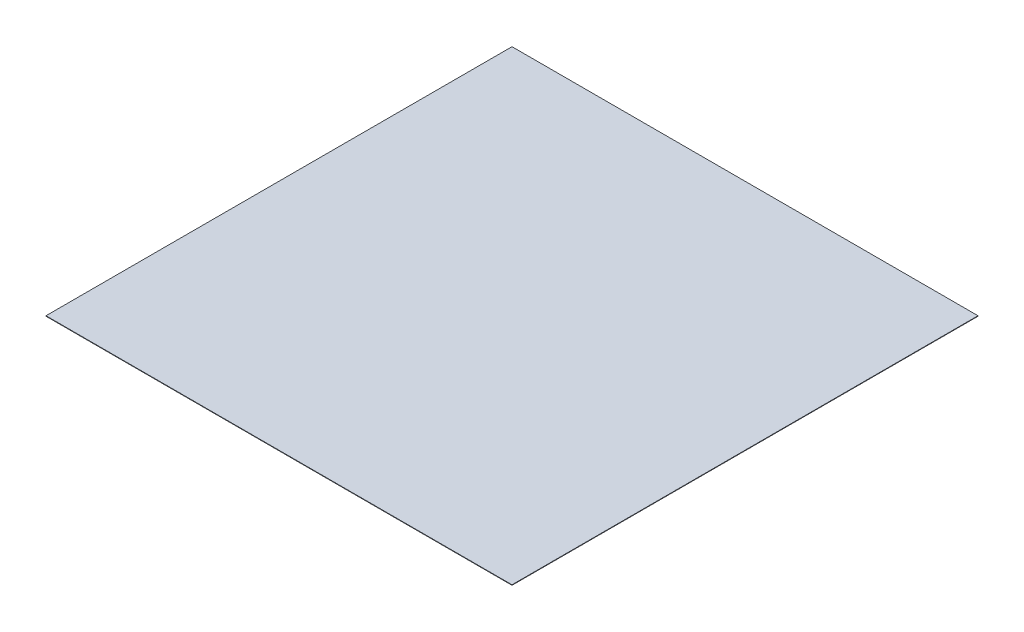
ISO-10303-21;
HEADER;
FILE_DESCRIPTION(('STEP AP214'),'2;1');
FILE_NAME('part.step','',(''),(''),'','','');
FILE_SCHEMA(('AUTOMOTIVE_DESIGN { 1 0 10303 214 1 1 1 1 }'));
ENDSEC;
DATA;
#1=APPLICATION_CONTEXT('core data for automotive mechanical design processes');
#2=APPLICATION_PROTOCOL_DEFINITION('international standard','automotive_design',2000,#1);
#3=PRODUCT_CONTEXT('',#1,'mechanical');
#4=PRODUCT('Part','Part','',(#3));
#5=PRODUCT_RELATED_PRODUCT_CATEGORY('part','',(#4));
#6=PRODUCT_DEFINITION_FORMATION('','',#4);
#7=PRODUCT_DEFINITION_CONTEXT('part definition',#1,'design');
#8=PRODUCT_DEFINITION('design','',#6,#7);
#9=PRODUCT_DEFINITION_SHAPE('','',#8);
#10=(LENGTH_UNIT() NAMED_UNIT(*) SI_UNIT(.MILLI.,.METRE.));
#11=(NAMED_UNIT(*) PLANE_ANGLE_UNIT() SI_UNIT($,.RADIAN.));
#12=(NAMED_UNIT(*) SI_UNIT($,.STERADIAN.) SOLID_ANGLE_UNIT());
#13=UNCERTAINTY_MEASURE_WITH_UNIT(LENGTH_MEASURE(1.E-05),#10,'distance_accuracy_value','');
#14=(GEOMETRIC_REPRESENTATION_CONTEXT(3) GLOBAL_UNCERTAINTY_ASSIGNED_CONTEXT((#13)) GLOBAL_UNIT_ASSIGNED_CONTEXT((#10,
#11,#12)) REPRESENTATION_CONTEXT('',''));
#15=CARTESIAN_POINT('',(0.,0.,0.));
#16=DIRECTION('',(0.,0.,1.));
#17=DIRECTION('',(1.,0.,0.));
#18=AXIS2_PLACEMENT_3D('',#15,#16,#17);
#19=CARTESIAN_POINT('',(0.,0.,0.));
#20=DIRECTION('',(0.,1.,0.));
#21=DIRECTION('',(1.,0.,0.));
#22=AXIS2_PLACEMENT_3D('',#19,#20,#21);
#23=PLANE('',#22);
#24=DIRECTION('',(1.,0.,0.));
#25=VECTOR('',#24,1.);
#26=CARTESIAN_POINT('',(-5.,0.,5.));
#27=LINE('',#26,#25);
#28=CARTESIAN_POINT('',(-5.,0.,5.));
#29=VERTEX_POINT('',#28);
#30=CARTESIAN_POINT('',(5.,0.,5.));
#31=VERTEX_POINT('',#30);
#32=EDGE_CURVE('E11',#29,#31,#27,.T.);
#33=ORIENTED_EDGE('',*,*,#32,.F.);
#34=DIRECTION('',(0.,0.,1.));
#35=VECTOR('',#34,1.);
#36=CARTESIAN_POINT('',(-5.,0.,-5.));
#37=LINE('',#36,#35);
#38=CARTESIAN_POINT('',(-5.,0.,-5.));
#39=VERTEX_POINT('',#38);
#40=EDGE_CURVE('E24',#39,#29,#37,.T.);
#41=ORIENTED_EDGE('',*,*,#40,.F.);
#42=DIRECTION('',(-1.,0.,0.));
#43=VECTOR('',#42,1.);
#44=CARTESIAN_POINT('',(5.,0.,-5.));
#45=LINE('',#44,#43);
#46=CARTESIAN_POINT('',(5.,0.,-5.));
#47=VERTEX_POINT('',#46);
#48=EDGE_CURVE('E61',#47,#39,#45,.T.);
#49=ORIENTED_EDGE('',*,*,#48,.F.);
#50=DIRECTION('',(0.,0.,-1.));
#51=VECTOR('',#50,1.);
#52=CARTESIAN_POINT('',(5.,0.,5.));
#53=LINE('',#52,#51);
#54=EDGE_CURVE('E37',#31,#47,#53,.T.);
#55=ORIENTED_EDGE('',*,*,#54,.F.);
#56=EDGE_LOOP('',(#33,#41,#49,#55));
#57=FACE_BOUND('',#56,.T.);
#58=ADVANCED_FACE('F17',(#57),#23,.F.);
#59=CARTESIAN_POINT('',(5.,0.,5.));
#60=DIRECTION('',(1.,0.,0.));
#61=DIRECTION('',(0.,0.,-1.));
#62=AXIS2_PLACEMENT_3D('',#59,#60,#61);
#63=PLANE('',#62);
#64=DIRECTION('',(0.,1.,0.));
#65=VECTOR('',#64,1.);
#66=CARTESIAN_POINT('',(5.,0.,-5.));
#67=LINE('',#66,#65);
#68=CARTESIAN_POINT('',(5.,0.01,-5.));
#69=VERTEX_POINT('',#68);
#70=EDGE_CURVE('E84',#47,#69,#67,.T.);
#71=ORIENTED_EDGE('',*,*,#70,.T.);
#72=DIRECTION('',(0.,0.,-1.));
#73=VECTOR('',#72,1.);
#74=CARTESIAN_POINT('',(5.,0.01,5.));
#75=LINE('',#74,#73);
#76=CARTESIAN_POINT('',(5.,0.01,5.));
#77=VERTEX_POINT('',#76);
#78=EDGE_CURVE('E74',#77,#69,#75,.T.);
#79=ORIENTED_EDGE('',*,*,#78,.F.);
#80=DIRECTION('',(0.,1.,0.));
#81=VECTOR('',#80,1.);
#82=CARTESIAN_POINT('',(5.,0.,5.));
#83=LINE('',#82,#81);
#84=EDGE_CURVE('E81',#31,#77,#83,.T.);
#85=ORIENTED_EDGE('',*,*,#84,.F.);
#86=ORIENTED_EDGE('',*,*,#54,.T.);
#87=EDGE_LOOP('',(#71,#79,#85,#86));
#88=FACE_BOUND('',#87,.T.);
#89=ADVANCED_FACE('F89',(#88),#63,.T.);
#90=CARTESIAN_POINT('',(-5.,0.,5.));
#91=DIRECTION('',(0.,0.,1.));
#92=DIRECTION('',(1.,0.,0.));
#93=AXIS2_PLACEMENT_3D('',#90,#91,#92);
#94=PLANE('',#93);
#95=ORIENTED_EDGE('',*,*,#84,.T.);
#96=DIRECTION('',(1.,0.,0.));
#97=VECTOR('',#96,1.);
#98=CARTESIAN_POINT('',(-5.,0.01,5.));
#99=LINE('',#98,#97);
#100=CARTESIAN_POINT('',(-5.,0.01,5.));
#101=VERTEX_POINT('',#100);
#102=EDGE_CURVE('E79',#101,#77,#99,.T.);
#103=ORIENTED_EDGE('',*,*,#102,.F.);
#104=DIRECTION('',(0.,1.,0.));
#105=VECTOR('',#104,1.);
#106=CARTESIAN_POINT('',(-5.,0.,5.));
#107=LINE('',#106,#105);
#108=EDGE_CURVE('E67',#29,#101,#107,.T.);
#109=ORIENTED_EDGE('',*,*,#108,.F.);
#110=ORIENTED_EDGE('',*,*,#32,.T.);
#111=EDGE_LOOP('',(#95,#103,#109,#110));
#112=FACE_BOUND('',#111,.T.);
#113=ADVANCED_FACE('F91',(#112),#94,.T.);
#114=CARTESIAN_POINT('',(-5.,0.,-5.));
#115=DIRECTION('',(-1.,0.,0.));
#116=DIRECTION('',(0.,0.,1.));
#117=AXIS2_PLACEMENT_3D('',#114,#115,#116);
#118=PLANE('',#117);
#119=ORIENTED_EDGE('',*,*,#108,.T.);
#120=DIRECTION('',(0.,0.,1.));
#121=VECTOR('',#120,1.);
#122=CARTESIAN_POINT('',(-5.,0.01,-5.));
#123=LINE('',#122,#121);
#124=CARTESIAN_POINT('',(-5.,0.01,-5.));
#125=VERTEX_POINT('',#124);
#126=EDGE_CURVE('E62',#125,#101,#123,.T.);
#127=ORIENTED_EDGE('',*,*,#126,.F.);
#128=DIRECTION('',(0.,1.,0.));
#129=VECTOR('',#128,1.);
#130=CARTESIAN_POINT('',(-5.,0.,-5.));
#131=LINE('',#130,#129);
#132=EDGE_CURVE('E55',#39,#125,#131,.T.);
#133=ORIENTED_EDGE('',*,*,#132,.F.);
#134=ORIENTED_EDGE('',*,*,#40,.T.);
#135=EDGE_LOOP('',(#119,#127,#133,#134));
#136=FACE_BOUND('',#135,.T.);
#137=ADVANCED_FACE('F65',(#136),#118,.T.);
#138=CARTESIAN_POINT('',(5.,0.,-5.));
#139=DIRECTION('',(0.,0.,-1.));
#140=DIRECTION('',(-1.,0.,0.));
#141=AXIS2_PLACEMENT_3D('',#138,#139,#140);
#142=PLANE('',#141);
#143=ORIENTED_EDGE('',*,*,#132,.T.);
#144=DIRECTION('',(-1.,0.,0.));
#145=VECTOR('',#144,1.);
#146=CARTESIAN_POINT('',(5.,0.01,-5.));
#147=LINE('',#146,#145);
#148=EDGE_CURVE('E60',#69,#125,#147,.T.);
#149=ORIENTED_EDGE('',*,*,#148,.F.);
#150=ORIENTED_EDGE('',*,*,#70,.F.);
#151=ORIENTED_EDGE('',*,*,#48,.T.);
#152=EDGE_LOOP('',(#143,#149,#150,#151));
#153=FACE_BOUND('',#152,.T.);
#154=ADVANCED_FACE('F57',(#153),#142,.T.);
#155=CARTESIAN_POINT('',(0.,0.01,0.));
#156=DIRECTION('',(0.,1.,0.));
#157=DIRECTION('',(1.,0.,0.));
#158=AXIS2_PLACEMENT_3D('',#155,#156,#157);
#159=PLANE('',#158);
#160=ORIENTED_EDGE('',*,*,#148,.T.);
#161=ORIENTED_EDGE('',*,*,#126,.T.);
#162=ORIENTED_EDGE('',*,*,#102,.T.);
#163=ORIENTED_EDGE('',*,*,#78,.T.);
#164=EDGE_LOOP('',(#160,#161,#162,#163));
#165=FACE_BOUND('',#164,.T.);
#166=ADVANCED_FACE('F72',(#165),#159,.T.);
#167=CLOSED_SHELL('',(#58,#89,#113,#137,#154,#166));
#168=MANIFOLD_SOLID_BREP('B1',#167);
#169=ADVANCED_BREP_SHAPE_REPRESENTATION('',(#18,#168),#14);
#170=SHAPE_DEFINITION_REPRESENTATION(#9,#169);
ENDSEC;
END-ISO-10303-21;
